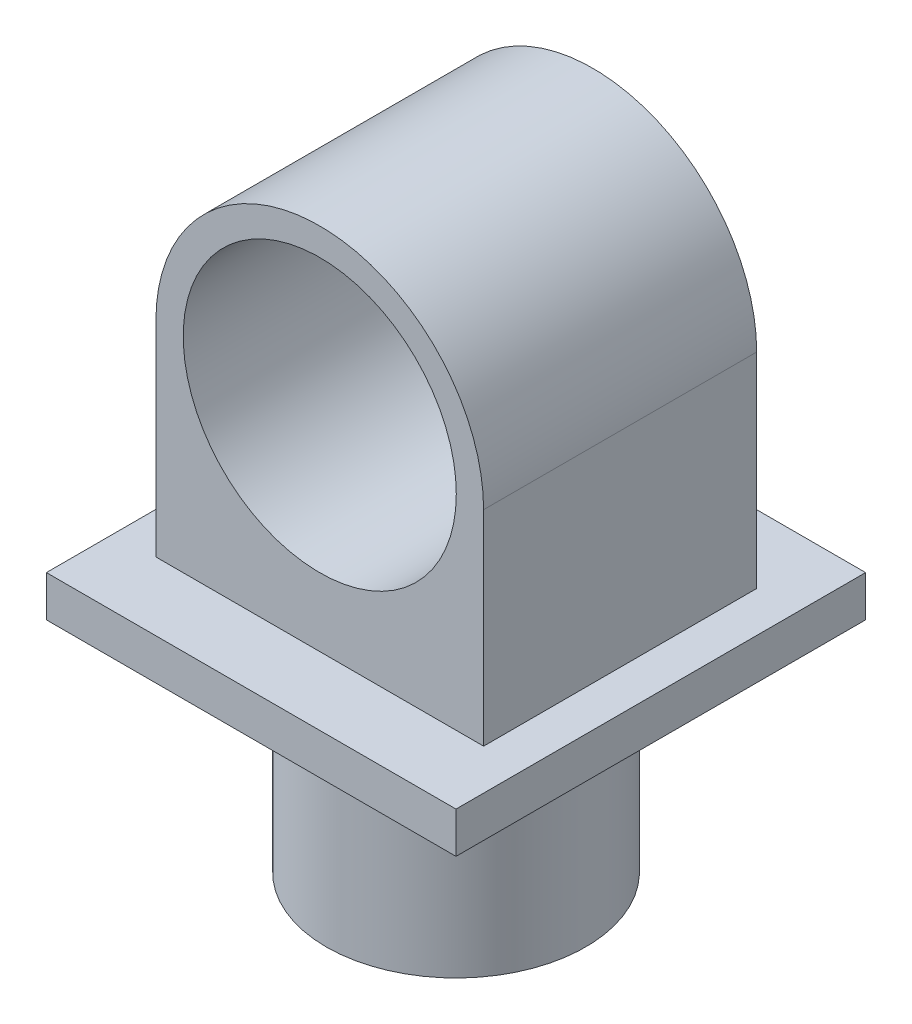
ISO-10303-21;
HEADER;
FILE_DESCRIPTION(('STEP AP214'),'2;1');
FILE_NAME('part.step','',(''),(''),'','','');
FILE_SCHEMA(('AUTOMOTIVE_DESIGN { 1 0 10303 214 1 1 1 1 }'));
ENDSEC;
DATA;
#1=APPLICATION_CONTEXT('core data for automotive mechanical design processes');
#2=APPLICATION_PROTOCOL_DEFINITION('international standard','automotive_design',2000,#1);
#3=PRODUCT_CONTEXT('',#1,'mechanical');
#4=PRODUCT('Part','Part','',(#3));
#5=PRODUCT_RELATED_PRODUCT_CATEGORY('part','',(#4));
#6=PRODUCT_DEFINITION_FORMATION('','',#4);
#7=PRODUCT_DEFINITION_CONTEXT('part definition',#1,'design');
#8=PRODUCT_DEFINITION('design','',#6,#7);
#9=PRODUCT_DEFINITION_SHAPE('','',#8);
#10=(LENGTH_UNIT() NAMED_UNIT(*) SI_UNIT(.MILLI.,.METRE.));
#11=(NAMED_UNIT(*) PLANE_ANGLE_UNIT() SI_UNIT($,.RADIAN.));
#12=(NAMED_UNIT(*) SI_UNIT($,.STERADIAN.) SOLID_ANGLE_UNIT());
#13=UNCERTAINTY_MEASURE_WITH_UNIT(LENGTH_MEASURE(1.E-05),#10,'distance_accuracy_value','');
#14=(GEOMETRIC_REPRESENTATION_CONTEXT(3) GLOBAL_UNCERTAINTY_ASSIGNED_CONTEXT((#13)) GLOBAL_UNIT_ASSIGNED_CONTEXT((#10,
#11,#12)) REPRESENTATION_CONTEXT('',''));
#15=CARTESIAN_POINT('',(0.,0.,0.));
#16=DIRECTION('',(0.,0.,1.));
#17=DIRECTION('',(1.,0.,0.));
#18=AXIS2_PLACEMENT_3D('',#15,#16,#17);
#19=CARTESIAN_POINT('',(0.,80.,0.));
#20=DIRECTION('',(0.,-1.,0.));
#21=DIRECTION('',(0.,0.,-1.));
#22=AXIS2_PLACEMENT_3D('',#19,#20,#21);
#23=CYLINDRICAL_SURFACE('',#22,47.5);
#24=CARTESIAN_POINT('',(0.,80.,0.));
#25=DIRECTION('',(0.,1.,0.));
#26=DIRECTION('',(0.,0.,1.));
#27=AXIS2_PLACEMENT_3D('',#24,#25,#26);
#28=CIRCLE('',#27,47.5);
#29=CARTESIAN_POINT('',(0.,80.,47.5));
#30=VERTEX_POINT('',#29);
#31=EDGE_CURVE('E11',#30,#30,#28,.T.);
#32=ORIENTED_EDGE('',*,*,#31,.F.);
#33=EDGE_LOOP('',(#32));
#34=FACE_BOUND('',#33,.T.);
#35=CARTESIAN_POINT('',(0.,0.,0.));
#36=DIRECTION('',(0.,1.,0.));
#37=DIRECTION('',(0.,0.,1.));
#38=AXIS2_PLACEMENT_3D('',#35,#36,#37);
#39=CIRCLE('',#38,47.5);
#40=CARTESIAN_POINT('',(0.,0.,47.5));
#41=VERTEX_POINT('',#40);
#42=EDGE_CURVE('E36',#41,#41,#39,.T.);
#43=ORIENTED_EDGE('',*,*,#42,.T.);
#44=EDGE_LOOP('',(#43));
#45=FACE_BOUND('',#44,.T.);
#46=ADVANCED_FACE('F33',(#34,#45),#23,.T.);
#47=CARTESIAN_POINT('',(0.,0.,0.));
#48=DIRECTION('',(0.,1.,0.));
#49=DIRECTION('',(0.,0.,1.));
#50=AXIS2_PLACEMENT_3D('',#47,#48,#49);
#51=PLANE('',#50);
#52=ORIENTED_EDGE('',*,*,#42,.F.);
#53=EDGE_LOOP('',(#52));
#54=FACE_BOUND('',#53,.T.);
#55=ADVANCED_FACE('F166',(#54),#51,.F.);
#56=CARTESIAN_POINT('',(74.9999999999999,95.,75.));
#57=DIRECTION('',(-1.,0.,0.));
#58=DIRECTION('',(0.,0.,1.));
#59=AXIS2_PLACEMENT_3D('',#56,#57,#58);
#60=PLANE('',#59);
#61=DIRECTION('',(0.,0.,-1.));
#62=VECTOR('',#61,1.);
#63=CARTESIAN_POINT('',(74.9999999999999,80.,75.));
#64=LINE('',#63,#62);
#65=CARTESIAN_POINT('',(74.9999999999999,80.,75.));
#66=VERTEX_POINT('',#65);
#67=CARTESIAN_POINT('',(74.9999999999999,80.,-75.));
#68=VERTEX_POINT('',#67);
#69=EDGE_CURVE('E134',#66,#68,#64,.T.);
#70=ORIENTED_EDGE('',*,*,#69,.T.);
#71=DIRECTION('',(0.,-1.,0.));
#72=VECTOR('',#71,1.);
#73=CARTESIAN_POINT('',(74.9999999999999,95.,-75.));
#74=LINE('',#73,#72);
#75=CARTESIAN_POINT('',(74.9999999999999,95.,-75.));
#76=VERTEX_POINT('',#75);
#77=EDGE_CURVE('E160',#76,#68,#74,.T.);
#78=ORIENTED_EDGE('',*,*,#77,.F.);
#79=DIRECTION('',(0.,0.,-1.));
#80=VECTOR('',#79,1.);
#81=CARTESIAN_POINT('',(74.9999999999999,95.,75.));
#82=LINE('',#81,#80);
#83=CARTESIAN_POINT('',(74.9999999999999,95.,75.));
#84=VERTEX_POINT('',#83);
#85=EDGE_CURVE('E143',#84,#76,#82,.T.);
#86=ORIENTED_EDGE('',*,*,#85,.F.);
#87=DIRECTION('',(0.,-1.,0.));
#88=VECTOR('',#87,1.);
#89=CARTESIAN_POINT('',(74.9999999999999,95.,75.));
#90=LINE('',#89,#88);
#91=EDGE_CURVE('E148',#84,#66,#90,.T.);
#92=ORIENTED_EDGE('',*,*,#91,.T.);
#93=EDGE_LOOP('',(#70,#78,#86,#92));
#94=FACE_BOUND('',#93,.T.);
#95=ADVANCED_FACE('F168',(#94),#60,.F.);
#96=CARTESIAN_POINT('',(-75.0000000000001,95.,-75.));
#97=DIRECTION('',(0.,0.,1.));
#98=DIRECTION('',(1.,0.,0.));
#99=AXIS2_PLACEMENT_3D('',#96,#97,#98);
#100=PLANE('',#99);
#101=DIRECTION('',(-1.,0.,0.));
#102=VECTOR('',#101,1.);
#103=CARTESIAN_POINT('',(-75.0000000000001,80.,-75.));
#104=LINE('',#103,#102);
#105=CARTESIAN_POINT('',(-75.0000000000001,80.,-75.));
#106=VERTEX_POINT('',#105);
#107=EDGE_CURVE('E137',#68,#106,#104,.T.);
#108=ORIENTED_EDGE('',*,*,#107,.T.);
#109=DIRECTION('',(0.,-1.,0.));
#110=VECTOR('',#109,1.);
#111=CARTESIAN_POINT('',(-75.0000000000001,95.,-75.));
#112=LINE('',#111,#110);
#113=CARTESIAN_POINT('',(-75.0000000000001,95.,-75.));
#114=VERTEX_POINT('',#113);
#115=EDGE_CURVE('E157',#114,#106,#112,.T.);
#116=ORIENTED_EDGE('',*,*,#115,.F.);
#117=DIRECTION('',(-1.,0.,0.));
#118=VECTOR('',#117,1.);
#119=CARTESIAN_POINT('',(-75.0000000000001,95.,-75.));
#120=LINE('',#119,#118);
#121=EDGE_CURVE('E85',#76,#114,#120,.T.);
#122=ORIENTED_EDGE('',*,*,#121,.F.);
#123=ORIENTED_EDGE('',*,*,#77,.T.);
#124=EDGE_LOOP('',(#108,#116,#122,#123));
#125=FACE_BOUND('',#124,.T.);
#126=ADVANCED_FACE('F173',(#125),#100,.F.);
#127=CARTESIAN_POINT('',(-75.0000000000001,95.,75.));
#128=DIRECTION('',(1.,0.,0.));
#129=DIRECTION('',(0.,0.,-1.));
#130=AXIS2_PLACEMENT_3D('',#127,#128,#129);
#131=PLANE('',#130);
#132=DIRECTION('',(0.,0.,1.));
#133=VECTOR('',#132,1.);
#134=CARTESIAN_POINT('',(-75.0000000000001,80.,75.));
#135=LINE('',#134,#133);
#136=CARTESIAN_POINT('',(-75.0000000000001,80.,75.));
#137=VERTEX_POINT('',#136);
#138=EDGE_CURVE('E151',#106,#137,#135,.T.);
#139=ORIENTED_EDGE('',*,*,#138,.T.);
#140=DIRECTION('',(0.,-1.,0.));
#141=VECTOR('',#140,1.);
#142=CARTESIAN_POINT('',(-75.0000000000001,95.,75.));
#143=LINE('',#142,#141);
#144=CARTESIAN_POINT('',(-75.0000000000001,95.,75.));
#145=VERTEX_POINT('',#144);
#146=EDGE_CURVE('E155',#145,#137,#143,.T.);
#147=ORIENTED_EDGE('',*,*,#146,.F.);
#148=DIRECTION('',(0.,0.,1.));
#149=VECTOR('',#148,1.);
#150=CARTESIAN_POINT('',(-75.0000000000001,95.,75.));
#151=LINE('',#150,#149);
#152=EDGE_CURVE('E146',#114,#145,#151,.T.);
#153=ORIENTED_EDGE('',*,*,#152,.F.);
#154=ORIENTED_EDGE('',*,*,#115,.T.);
#155=EDGE_LOOP('',(#139,#147,#153,#154));
#156=FACE_BOUND('',#155,.T.);
#157=ADVANCED_FACE('F180',(#156),#131,.F.);
#158=CARTESIAN_POINT('',(-75.0000000000001,95.,75.));
#159=DIRECTION('',(0.,0.,-1.));
#160=DIRECTION('',(-1.,0.,0.));
#161=AXIS2_PLACEMENT_3D('',#158,#159,#160);
#162=PLANE('',#161);
#163=DIRECTION('',(1.,0.,0.));
#164=VECTOR('',#163,1.);
#165=CARTESIAN_POINT('',(-75.0000000000001,80.,75.));
#166=LINE('',#165,#164);
#167=EDGE_CURVE('E77',#137,#66,#166,.T.);
#168=ORIENTED_EDGE('',*,*,#167,.T.);
#169=ORIENTED_EDGE('',*,*,#91,.F.);
#170=DIRECTION('',(1.,0.,0.));
#171=VECTOR('',#170,1.);
#172=CARTESIAN_POINT('',(-75.0000000000001,95.,75.));
#173=LINE('',#172,#171);
#174=EDGE_CURVE('E56',#145,#84,#173,.T.);
#175=ORIENTED_EDGE('',*,*,#174,.F.);
#176=ORIENTED_EDGE('',*,*,#146,.T.);
#177=EDGE_LOOP('',(#168,#169,#175,#176));
#178=FACE_BOUND('',#177,.T.);
#179=ADVANCED_FACE('F183',(#178),#162,.F.);
#180=CARTESIAN_POINT('',(0.,95.,0.));
#181=DIRECTION('',(0.,-1.,0.));
#182=DIRECTION('',(0.,0.,-1.));
#183=AXIS2_PLACEMENT_3D('',#180,#181,#182);
#184=PLANE('',#183);
#185=DIRECTION('',(0.,0.,-1.));
#186=VECTOR('',#185,1.);
#187=CARTESIAN_POINT('',(-59.8908762101716,95.,50.));
#188=LINE('',#187,#186);
#189=CARTESIAN_POINT('',(-59.8908762101716,95.,50.));
#190=VERTEX_POINT('',#189);
#191=CARTESIAN_POINT('',(-59.8908762101716,95.,-50.));
#192=VERTEX_POINT('',#191);
#193=EDGE_CURVE('E115',#190,#192,#188,.T.);
#194=ORIENTED_EDGE('',*,*,#193,.T.);
#195=DIRECTION('',(1.,0.,0.));
#196=VECTOR('',#195,1.);
#197=CARTESIAN_POINT('',(-59.8908762101716,95.,-50.));
#198=LINE('',#197,#196);
#199=CARTESIAN_POINT('',(60.1091237898284,95.,-50.));
#200=VERTEX_POINT('',#199);
#201=EDGE_CURVE('E47',#192,#200,#198,.T.);
#202=ORIENTED_EDGE('',*,*,#201,.T.);
#203=DIRECTION('',(0.,0.,-1.));
#204=VECTOR('',#203,1.);
#205=CARTESIAN_POINT('',(60.1091237898284,95.,50.));
#206=LINE('',#205,#204);
#207=CARTESIAN_POINT('',(60.1091237898284,95.,50.));
#208=VERTEX_POINT('',#207);
#209=EDGE_CURVE('E139',#208,#200,#206,.T.);
#210=ORIENTED_EDGE('',*,*,#209,.F.);
#211=DIRECTION('',(1.,0.,0.));
#212=VECTOR('',#211,1.);
#213=CARTESIAN_POINT('',(-59.8908762101716,95.,50.));
#214=LINE('',#213,#212);
#215=EDGE_CURVE('E118',#190,#208,#214,.T.);
#216=ORIENTED_EDGE('',*,*,#215,.F.);
#217=EDGE_LOOP('',(#194,#202,#210,#216));
#218=FACE_BOUND('',#217,.T.);
#219=ORIENTED_EDGE('',*,*,#85,.T.);
#220=ORIENTED_EDGE('',*,*,#121,.T.);
#221=ORIENTED_EDGE('',*,*,#152,.T.);
#222=ORIENTED_EDGE('',*,*,#174,.T.);
#223=EDGE_LOOP('',(#219,#220,#221,#222));
#224=FACE_BOUND('',#223,.T.);
#225=ADVANCED_FACE('F187',(#218,#224),#184,.F.);
#226=CARTESIAN_POINT('',(0.,80.,0.));
#227=DIRECTION('',(0.,-1.,0.));
#228=DIRECTION('',(0.,0.,-1.));
#229=AXIS2_PLACEMENT_3D('',#226,#227,#228);
#230=PLANE('',#229);
#231=ORIENTED_EDGE('',*,*,#31,.T.);
#232=EDGE_LOOP('',(#231));
#233=FACE_BOUND('',#232,.T.);
#234=ORIENTED_EDGE('',*,*,#69,.F.);
#235=ORIENTED_EDGE('',*,*,#167,.F.);
#236=ORIENTED_EDGE('',*,*,#138,.F.);
#237=ORIENTED_EDGE('',*,*,#107,.F.);
#238=EDGE_LOOP('',(#234,#235,#236,#237));
#239=FACE_BOUND('',#238,.T.);
#240=ADVANCED_FACE('F188',(#233,#239),#230,.T.);
#241=CARTESIAN_POINT('',(0.109123789828348,170.,50.));
#242=DIRECTION('',(0.,0.,-1.));
#243=DIRECTION('',(-1.,0.,0.));
#244=AXIS2_PLACEMENT_3D('',#241,#242,#243);
#245=PLANE('',#244);
#246=CARTESIAN_POINT('',(0.109123789828348,170.,50.));
#247=DIRECTION('',(0.,0.,1.));
#248=DIRECTION('',(-1.,0.,0.));
#249=AXIS2_PLACEMENT_3D('',#246,#247,#248);
#250=CIRCLE('',#249,60.);
#251=CARTESIAN_POINT('',(60.1091237898284,170.,50.));
#252=VERTEX_POINT('',#251);
#253=CARTESIAN_POINT('',(-59.8908762101716,170.,50.));
#254=VERTEX_POINT('',#253);
#255=EDGE_CURVE('E119',#252,#254,#250,.T.);
#256=ORIENTED_EDGE('',*,*,#255,.T.);
#257=DIRECTION('',(0.,-1.,0.));
#258=VECTOR('',#257,1.);
#259=CARTESIAN_POINT('',(-59.8908762101716,170.,50.));
#260=LINE('',#259,#258);
#261=EDGE_CURVE('E108',#254,#190,#260,.T.);
#262=ORIENTED_EDGE('',*,*,#261,.T.);
#263=ORIENTED_EDGE('',*,*,#215,.T.);
#264=DIRECTION('',(0.,1.,0.));
#265=VECTOR('',#264,1.);
#266=CARTESIAN_POINT('',(60.1091237898284,170.,50.));
#267=LINE('',#266,#265);
#268=EDGE_CURVE('E125',#208,#252,#267,.T.);
#269=ORIENTED_EDGE('',*,*,#268,.T.);
#270=EDGE_LOOP('',(#256,#262,#263,#269));
#271=FACE_BOUND('',#270,.T.);
#272=CARTESIAN_POINT('',(0.109123789828348,170.,50.));
#273=DIRECTION('',(0.,0.,1.));
#274=DIRECTION('',(1.,0.,0.));
#275=AXIS2_PLACEMENT_3D('',#272,#273,#274);
#276=CIRCLE('',#275,50.);
#277=CARTESIAN_POINT('',(50.1091237898284,170.,50.));
#278=VERTEX_POINT('',#277);
#279=EDGE_CURVE('E216',#278,#278,#276,.T.);
#280=ORIENTED_EDGE('',*,*,#279,.F.);
#281=EDGE_LOOP('',(#280));
#282=FACE_BOUND('',#281,.T.);
#283=ADVANCED_FACE('F122',(#271,#282),#245,.F.);
#284=CARTESIAN_POINT('',(0.109123789828348,170.,-50.));
#285=DIRECTION('',(0.,0.,-1.));
#286=DIRECTION('',(-1.,0.,0.));
#287=AXIS2_PLACEMENT_3D('',#284,#285,#286);
#288=PLANE('',#287);
#289=CARTESIAN_POINT('',(0.109123789828348,170.,-50.));
#290=DIRECTION('',(0.,0.,1.));
#291=DIRECTION('',(-1.,0.,0.));
#292=AXIS2_PLACEMENT_3D('',#289,#290,#291);
#293=CIRCLE('',#292,60.);
#294=CARTESIAN_POINT('',(60.1091237898284,170.,-50.));
#295=VERTEX_POINT('',#294);
#296=CARTESIAN_POINT('',(-59.8908762101716,170.,-50.));
#297=VERTEX_POINT('',#296);
#298=EDGE_CURVE('E133',#295,#297,#293,.T.);
#299=ORIENTED_EDGE('',*,*,#298,.F.);
#300=DIRECTION('',(0.,1.,0.));
#301=VECTOR('',#300,1.);
#302=CARTESIAN_POINT('',(60.1091237898284,170.,-50.));
#303=LINE('',#302,#301);
#304=EDGE_CURVE('E129',#200,#295,#303,.T.);
#305=ORIENTED_EDGE('',*,*,#304,.F.);
#306=ORIENTED_EDGE('',*,*,#201,.F.);
#307=DIRECTION('',(0.,-1.,0.));
#308=VECTOR('',#307,1.);
#309=CARTESIAN_POINT('',(-59.8908762101716,170.,-50.));
#310=LINE('',#309,#308);
#311=EDGE_CURVE('E228',#297,#192,#310,.T.);
#312=ORIENTED_EDGE('',*,*,#311,.F.);
#313=EDGE_LOOP('',(#299,#305,#306,#312));
#314=FACE_BOUND('',#313,.T.);
#315=CARTESIAN_POINT('',(0.109123789828348,170.,-50.));
#316=DIRECTION('',(0.,0.,1.));
#317=DIRECTION('',(1.,0.,0.));
#318=AXIS2_PLACEMENT_3D('',#315,#316,#317);
#319=CIRCLE('',#318,50.);
#320=CARTESIAN_POINT('',(50.1091237898284,170.,-50.));
#321=VERTEX_POINT('',#320);
#322=EDGE_CURVE('E219',#321,#321,#319,.T.);
#323=ORIENTED_EDGE('',*,*,#322,.T.);
#324=EDGE_LOOP('',(#323));
#325=FACE_BOUND('',#324,.T.);
#326=ADVANCED_FACE('F197',(#314,#325),#288,.T.);
#327=CARTESIAN_POINT('',(0.109123789828348,170.,50.));
#328=DIRECTION('',(0.,0.,-1.));
#329=DIRECTION('',(-1.,0.,0.));
#330=AXIS2_PLACEMENT_3D('',#327,#328,#329);
#331=CYLINDRICAL_SURFACE('',#330,60.);
#332=ORIENTED_EDGE('',*,*,#298,.T.);
#333=DIRECTION('',(0.,0.,-1.));
#334=VECTOR('',#333,1.);
#335=CARTESIAN_POINT('',(-59.8908762101716,170.,50.));
#336=LINE('',#335,#334);
#337=EDGE_CURVE('E112',#254,#297,#336,.T.);
#338=ORIENTED_EDGE('',*,*,#337,.F.);
#339=ORIENTED_EDGE('',*,*,#255,.F.);
#340=DIRECTION('',(0.,0.,-1.));
#341=VECTOR('',#340,1.);
#342=CARTESIAN_POINT('',(60.1091237898284,170.,50.));
#343=LINE('',#342,#341);
#344=EDGE_CURVE('E226',#252,#295,#343,.T.);
#345=ORIENTED_EDGE('',*,*,#344,.T.);
#346=EDGE_LOOP('',(#332,#338,#339,#345));
#347=FACE_BOUND('',#346,.T.);
#348=ADVANCED_FACE('F131',(#347),#331,.T.);
#349=CARTESIAN_POINT('',(-59.8908762101716,170.,50.));
#350=DIRECTION('',(1.,0.,0.));
#351=DIRECTION('',(0.,0.,-1.));
#352=AXIS2_PLACEMENT_3D('',#349,#350,#351);
#353=PLANE('',#352);
#354=ORIENTED_EDGE('',*,*,#311,.T.);
#355=ORIENTED_EDGE('',*,*,#193,.F.);
#356=ORIENTED_EDGE('',*,*,#261,.F.);
#357=ORIENTED_EDGE('',*,*,#337,.T.);
#358=EDGE_LOOP('',(#354,#355,#356,#357));
#359=FACE_BOUND('',#358,.T.);
#360=ADVANCED_FACE('F110',(#359),#353,.F.);
#361=CARTESIAN_POINT('',(60.1091237898284,170.,50.));
#362=DIRECTION('',(-1.,0.,0.));
#363=DIRECTION('',(0.,-1.,0.));
#364=AXIS2_PLACEMENT_3D('',#361,#362,#363);
#365=PLANE('',#364);
#366=ORIENTED_EDGE('',*,*,#304,.T.);
#367=ORIENTED_EDGE('',*,*,#344,.F.);
#368=ORIENTED_EDGE('',*,*,#268,.F.);
#369=ORIENTED_EDGE('',*,*,#209,.T.);
#370=EDGE_LOOP('',(#366,#367,#368,#369));
#371=FACE_BOUND('',#370,.T.);
#372=ADVANCED_FACE('F200',(#371),#365,.F.);
#373=CARTESIAN_POINT('',(0.109123789828348,170.,50.));
#374=DIRECTION('',(0.,0.,-1.));
#375=DIRECTION('',(-1.,0.,0.));
#376=AXIS2_PLACEMENT_3D('',#373,#374,#375);
#377=CYLINDRICAL_SURFACE('',#376,50.);
#378=ORIENTED_EDGE('',*,*,#279,.T.);
#379=EDGE_LOOP('',(#378));
#380=FACE_BOUND('',#379,.T.);
#381=ORIENTED_EDGE('',*,*,#322,.F.);
#382=EDGE_LOOP('',(#381));
#383=FACE_BOUND('',#382,.T.);
#384=ADVANCED_FACE('F203',(#380,#383),#377,.F.);
#385=CLOSED_SHELL('',(#46,#55,#95,#126,#157,#179,#225,#240,#283,#326,#348,#360,#372,#384));
#386=MANIFOLD_SOLID_BREP('B2',#385);
#387=ADVANCED_BREP_SHAPE_REPRESENTATION('',(#18,#386),#14);
#388=SHAPE_DEFINITION_REPRESENTATION(#9,#387);
ENDSEC;
END-ISO-10303-21;
